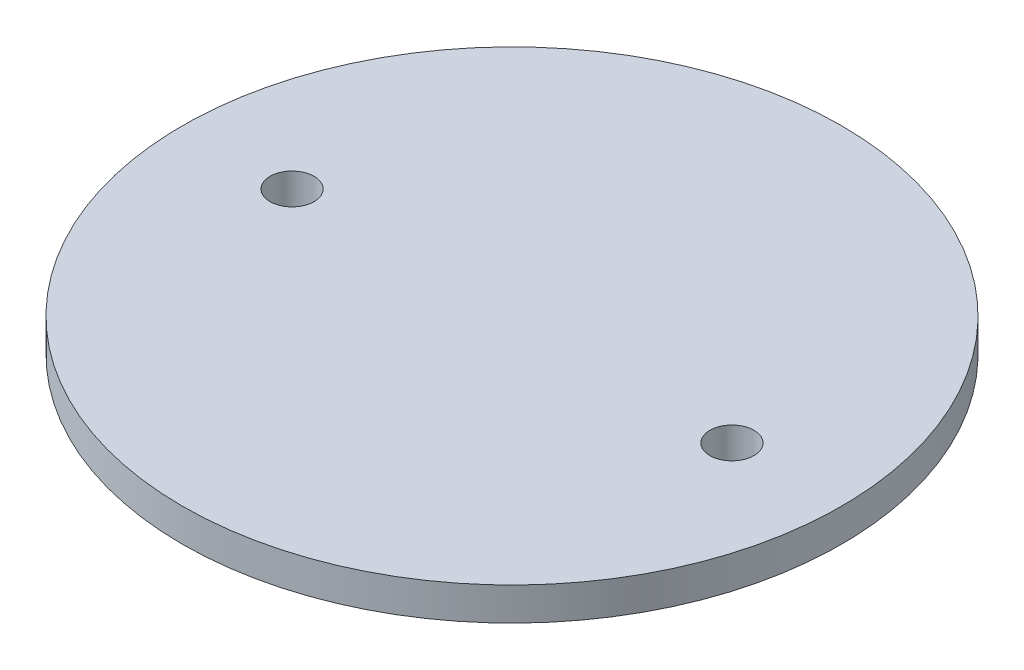
ISO-10303-21;
HEADER;
FILE_DESCRIPTION(('STEP AP214'),'2;1');
FILE_NAME('part.step','',(''),(''),'','','');
FILE_SCHEMA(('AUTOMOTIVE_DESIGN { 1 0 10303 214 1 1 1 1 }'));
ENDSEC;
DATA;
#1=APPLICATION_CONTEXT('core data for automotive mechanical design processes');
#2=APPLICATION_PROTOCOL_DEFINITION('international standard','automotive_design',2000,#1);
#3=PRODUCT_CONTEXT('',#1,'mechanical');
#4=PRODUCT('Part','Part','',(#3));
#5=PRODUCT_RELATED_PRODUCT_CATEGORY('part','',(#4));
#6=PRODUCT_DEFINITION_FORMATION('','',#4);
#7=PRODUCT_DEFINITION_CONTEXT('part definition',#1,'design');
#8=PRODUCT_DEFINITION('design','',#6,#7);
#9=PRODUCT_DEFINITION_SHAPE('','',#8);
#10=(LENGTH_UNIT() NAMED_UNIT(*) SI_UNIT(.MILLI.,.METRE.));
#11=(NAMED_UNIT(*) PLANE_ANGLE_UNIT() SI_UNIT($,.RADIAN.));
#12=(NAMED_UNIT(*) SI_UNIT($,.STERADIAN.) SOLID_ANGLE_UNIT());
#13=UNCERTAINTY_MEASURE_WITH_UNIT(LENGTH_MEASURE(1.E-05),#10,'distance_accuracy_value','');
#14=(GEOMETRIC_REPRESENTATION_CONTEXT(3) GLOBAL_UNCERTAINTY_ASSIGNED_CONTEXT((#13)) GLOBAL_UNIT_ASSIGNED_CONTEXT((#10,
#11,#12)) REPRESENTATION_CONTEXT('',''));
#15=CARTESIAN_POINT('',(0.,0.,0.));
#16=DIRECTION('',(0.,0.,1.));
#17=DIRECTION('',(1.,0.,0.));
#18=AXIS2_PLACEMENT_3D('',#15,#16,#17);
#19=CARTESIAN_POINT('',(0.,4.7625,0.));
#20=DIRECTION('',(0.,-1.,0.));
#21=DIRECTION('',(0.,0.,-1.));
#22=AXIS2_PLACEMENT_3D('',#19,#20,#21);
#23=CYLINDRICAL_SURFACE('',#22,47.575);
#24=CARTESIAN_POINT('',(0.,4.7625,0.));
#25=DIRECTION('',(0.,1.,0.));
#26=DIRECTION('',(0.,0.,1.));
#27=AXIS2_PLACEMENT_3D('',#24,#25,#26);
#28=CIRCLE('',#27,47.575);
#29=CARTESIAN_POINT('',(0.,4.7625,47.575));
#30=VERTEX_POINT('',#29);
#31=EDGE_CURVE('E11',#30,#30,#28,.T.);
#32=ORIENTED_EDGE('',*,*,#31,.F.);
#33=EDGE_LOOP('',(#32));
#34=FACE_BOUND('',#33,.T.);
#35=CARTESIAN_POINT('',(0.,0.,0.));
#36=DIRECTION('',(0.,1.,0.));
#37=DIRECTION('',(0.,0.,1.));
#38=AXIS2_PLACEMENT_3D('',#35,#36,#37);
#39=CIRCLE('',#38,47.575);
#40=CARTESIAN_POINT('',(0.,0.,47.575));
#41=VERTEX_POINT('',#40);
#42=EDGE_CURVE('E48',#41,#41,#39,.T.);
#43=ORIENTED_EDGE('',*,*,#42,.T.);
#44=EDGE_LOOP('',(#43));
#45=FACE_BOUND('',#44,.T.);
#46=ADVANCED_FACE('F45',(#34,#45),#23,.T.);
#47=CARTESIAN_POINT('',(0.,4.7625,0.));
#48=DIRECTION('',(0.,1.,0.));
#49=DIRECTION('',(0.,0.,1.));
#50=AXIS2_PLACEMENT_3D('',#47,#48,#49);
#51=PLANE('',#50);
#52=CARTESIAN_POINT('',(31.75,4.7625,0.));
#53=DIRECTION('',(0.,1.,0.));
#54=DIRECTION('',(0.,0.,1.));
#55=AXIS2_PLACEMENT_3D('',#52,#53,#54);
#56=CIRCLE('',#55,3.17500000000001);
#57=CARTESIAN_POINT('',(31.75,4.7625,3.17500000000001));
#58=VERTEX_POINT('',#57);
#59=EDGE_CURVE('E100',#58,#58,#56,.T.);
#60=ORIENTED_EDGE('',*,*,#59,.F.);
#61=EDGE_LOOP('',(#60));
#62=FACE_BOUND('',#61,.T.);
#63=CARTESIAN_POINT('',(-31.75,4.7625,0.));
#64=DIRECTION('',(0.,1.,0.));
#65=DIRECTION('',(0.,0.,1.));
#66=AXIS2_PLACEMENT_3D('',#63,#64,#65);
#67=CIRCLE('',#66,3.175);
#68=CARTESIAN_POINT('',(-31.75,4.7625,3.175));
#69=VERTEX_POINT('',#68);
#70=EDGE_CURVE('E61',#69,#69,#67,.T.);
#71=ORIENTED_EDGE('',*,*,#70,.F.);
#72=EDGE_LOOP('',(#71));
#73=FACE_BOUND('',#72,.T.);
#74=ORIENTED_EDGE('',*,*,#31,.T.);
#75=EDGE_LOOP('',(#74));
#76=FACE_BOUND('',#75,.T.);
#77=ADVANCED_FACE('F120',(#62,#73,#76),#51,.T.);
#78=CARTESIAN_POINT('',(0.,0.,0.));
#79=DIRECTION('',(0.,1.,0.));
#80=DIRECTION('',(0.,0.,1.));
#81=AXIS2_PLACEMENT_3D('',#78,#79,#80);
#82=PLANE('',#81);
#83=CARTESIAN_POINT('',(31.75,0.,0.));
#84=DIRECTION('',(0.,1.,0.));
#85=DIRECTION('',(0.,0.,1.));
#86=AXIS2_PLACEMENT_3D('',#83,#84,#85);
#87=CIRCLE('',#86,3.17500000000001);
#88=CARTESIAN_POINT('',(31.75,0.,3.17500000000001));
#89=VERTEX_POINT('',#88);
#90=EDGE_CURVE('E58',#89,#89,#87,.T.);
#91=ORIENTED_EDGE('',*,*,#90,.T.);
#92=EDGE_LOOP('',(#91));
#93=FACE_BOUND('',#92,.T.);
#94=CARTESIAN_POINT('',(-31.75,0.,0.));
#95=DIRECTION('',(0.,1.,0.));
#96=DIRECTION('',(0.,0.,1.));
#97=AXIS2_PLACEMENT_3D('',#94,#95,#96);
#98=CIRCLE('',#97,3.175);
#99=CARTESIAN_POINT('',(-31.75,0.,3.175));
#100=VERTEX_POINT('',#99);
#101=EDGE_CURVE('E96',#100,#100,#98,.T.);
#102=ORIENTED_EDGE('',*,*,#101,.T.);
#103=EDGE_LOOP('',(#102));
#104=FACE_BOUND('',#103,.T.);
#105=ORIENTED_EDGE('',*,*,#42,.F.);
#106=EDGE_LOOP('',(#105));
#107=FACE_BOUND('',#106,.T.);
#108=ADVANCED_FACE('F109',(#93,#104,#107),#82,.F.);
#109=CARTESIAN_POINT('',(-31.75,0.,0.));
#110=DIRECTION('',(0.,1.,0.));
#111=DIRECTION('',(0.,0.,1.));
#112=AXIS2_PLACEMENT_3D('',#109,#110,#111);
#113=CYLINDRICAL_SURFACE('',#112,3.175);
#114=ORIENTED_EDGE('',*,*,#101,.F.);
#115=EDGE_LOOP('',(#114));
#116=FACE_BOUND('',#115,.T.);
#117=ORIENTED_EDGE('',*,*,#70,.T.);
#118=EDGE_LOOP('',(#117));
#119=FACE_BOUND('',#118,.T.);
#120=ADVANCED_FACE('F115',(#116,#119),#113,.F.);
#121=CARTESIAN_POINT('',(31.75,0.,0.));
#122=DIRECTION('',(0.,1.,0.));
#123=DIRECTION('',(0.,0.,1.));
#124=AXIS2_PLACEMENT_3D('',#121,#122,#123);
#125=CYLINDRICAL_SURFACE('',#124,3.17500000000001);
#126=ORIENTED_EDGE('',*,*,#90,.F.);
#127=EDGE_LOOP('',(#126));
#128=FACE_BOUND('',#127,.T.);
#129=ORIENTED_EDGE('',*,*,#59,.T.);
#130=EDGE_LOOP('',(#129));
#131=FACE_BOUND('',#130,.T.);
#132=ADVANCED_FACE('F112',(#128,#131),#125,.F.);
#133=CLOSED_SHELL('',(#46,#77,#108,#120,#132));
#134=MANIFOLD_SOLID_BREP('B2',#133);
#135=ADVANCED_BREP_SHAPE_REPRESENTATION('',(#18,#134),#14);
#136=SHAPE_DEFINITION_REPRESENTATION(#9,#135);
ENDSEC;
END-ISO-10303-21;
